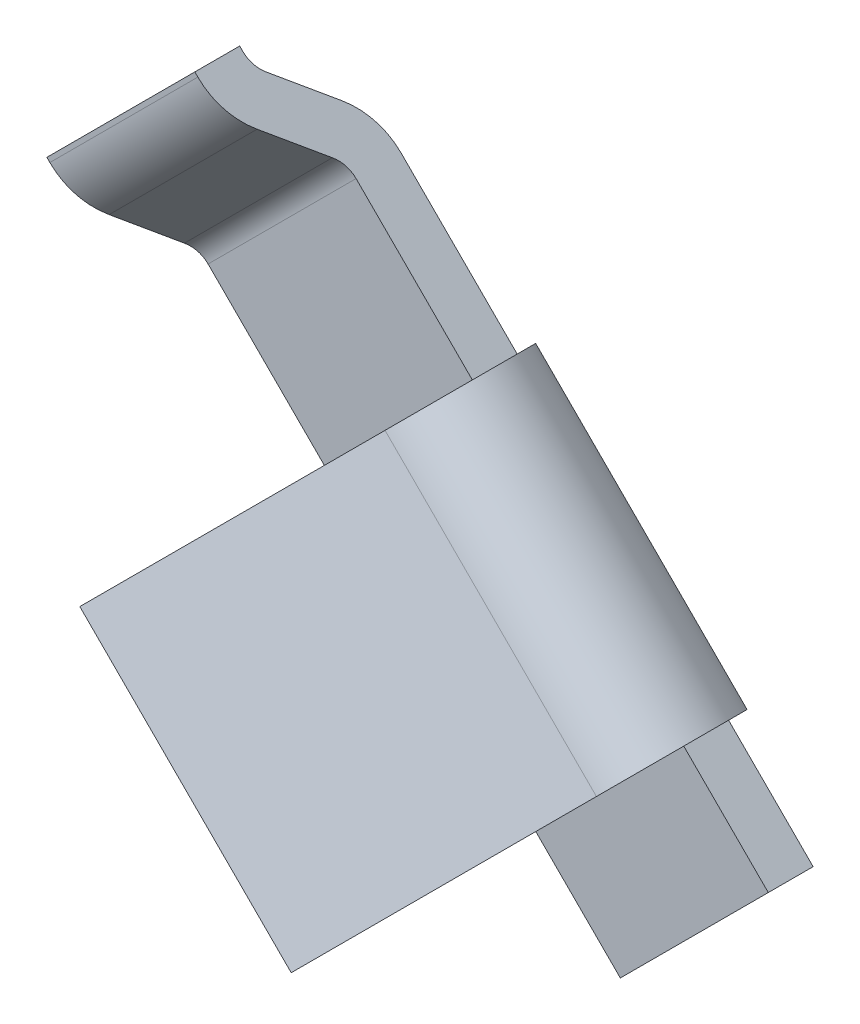
ISO-10303-21;
HEADER;
FILE_DESCRIPTION(('STEP AP214'),'2;1');
FILE_NAME('part.step','',(''),(''),'','','');
FILE_SCHEMA(('AUTOMOTIVE_DESIGN { 1 0 10303 214 1 1 1 1 }'));
ENDSEC;
DATA;
#1=APPLICATION_CONTEXT('core data for automotive mechanical design processes');
#2=APPLICATION_PROTOCOL_DEFINITION('international standard','automotive_design',2000,#1);
#3=PRODUCT_CONTEXT('',#1,'mechanical');
#4=PRODUCT('Part','Part','',(#3));
#5=PRODUCT_RELATED_PRODUCT_CATEGORY('part','',(#4));
#6=PRODUCT_DEFINITION_FORMATION('','',#4);
#7=PRODUCT_DEFINITION_CONTEXT('part definition',#1,'design');
#8=PRODUCT_DEFINITION('design','',#6,#7);
#9=PRODUCT_DEFINITION_SHAPE('','',#8);
#10=(LENGTH_UNIT() NAMED_UNIT(*) SI_UNIT(.MILLI.,.METRE.));
#11=(NAMED_UNIT(*) PLANE_ANGLE_UNIT() SI_UNIT($,.RADIAN.));
#12=(NAMED_UNIT(*) SI_UNIT($,.STERADIAN.) SOLID_ANGLE_UNIT());
#13=UNCERTAINTY_MEASURE_WITH_UNIT(LENGTH_MEASURE(1.E-05),#10,'distance_accuracy_value','');
#14=(GEOMETRIC_REPRESENTATION_CONTEXT(3) GLOBAL_UNCERTAINTY_ASSIGNED_CONTEXT((#13)) GLOBAL_UNIT_ASSIGNED_CONTEXT((#10,
#11,#12)) REPRESENTATION_CONTEXT('',''));
#15=CARTESIAN_POINT('',(0.,0.,0.));
#16=DIRECTION('',(0.,0.,1.));
#17=DIRECTION('',(1.,0.,0.));
#18=AXIS2_PLACEMENT_3D('',#15,#16,#17);
#19=CARTESIAN_POINT('',(4.200267948409,-3.705293201578,0.025));
#20=DIRECTION('',(0.707106781186548,-0.707106781186548,0.));
#21=DIRECTION('',(0.707106781186548,0.707106781186548,0.));
#22=AXIS2_PLACEMENT_3D('',#19,#20,#21);
#23=CYLINDRICAL_SURFACE('',#22,0.275);
#24=DIRECTION('',(-0.707106781187048,0.707106781186048,0.));
#25=VECTOR('',#24,1.);
#26=CARTESIAN_POINT('',(4.143071785687,-3.648097038856,-0.25));
#27=LINE('',#26,#25);
#28=CARTESIAN_POINT('',(4.143071785687,-3.648097038856,-0.25));
#29=VERTEX_POINT('',#28);
#30=CARTESIAN_POINT('',(3.43596500450025,-2.94099025766975,-0.25));
#31=VERTEX_POINT('',#30);
#32=EDGE_CURVE('E121',#29,#31,#27,.T.);
#33=ORIENTED_EDGE('',*,*,#32,.T.);
#34=CARTESIAN_POINT('',(3.4359650045005,-2.9409902576695,0.025));
#35=DIRECTION('',(0.707106781186548,-0.707106781186548,0.));
#36=DIRECTION('',(0.707106781186548,0.707106781186548,0.));
#37=AXIS2_PLACEMENT_3D('',#34,#35,#36);
#38=CIRCLE('',#37,0.275);
#39=CARTESIAN_POINT('',(3.51814497015121,-2.85881029201879,0.274234641435167));
#40=VERTEX_POINT('',#39);
#41=EDGE_CURVE('E19',#40,#31,#38,.F.);
#42=ORIENTED_EDGE('',*,*,#41,.F.);
#43=DIRECTION('',(-0.707106781186958,0.707106781186137,2.70833702686897E-13));
#44=VECTOR('',#43,1.);
#45=CARTESIAN_POINT('',(4.22525175133808,-3.56591707320492,0.274234641435235));
#46=LINE('',#45,#44);
#47=CARTESIAN_POINT('',(4.22525175133791,-3.56591707320509,0.274234641435203));
#48=VERTEX_POINT('',#47);
#49=EDGE_CURVE('E109',#48,#40,#46,.T.);
#50=ORIENTED_EDGE('',*,*,#49,.F.);
#51=CARTESIAN_POINT('',(4.143071785687,-3.648097038856,0.025));
#52=DIRECTION('',(0.707106781186548,-0.707106781186548,0.));
#53=DIRECTION('',(0.707106781186548,0.707106781186548,0.));
#54=AXIS2_PLACEMENT_3D('',#51,#52,#53);
#55=CIRCLE('',#54,0.275);
#56=EDGE_CURVE('E149',#29,#48,#55,.T.);
#57=ORIENTED_EDGE('',*,*,#56,.F.);
#58=EDGE_LOOP('',(#33,#42,#50,#57));
#59=FACE_BOUND('',#58,.T.);
#60=ADVANCED_FACE('F16',(#59),#23,.T.);
#61=CARTESIAN_POINT('',(2.902922843378,-3.474032418792,0.679948172706));
#62=DIRECTION('',(0.298836238729927,0.298836238729927,0.906307787036777));
#63=DIRECTION('',(0.949705125315019,0.,-0.313145613014751));
#64=AXIS2_PLACEMENT_3D('',#61,#62,#63);
#65=PLANE('',#64);
#66=DIRECTION('',(-0.707106781186547,0.707106781186547,0.));
#67=VECTOR('',#66,1.);
#68=CARTESIAN_POINT('',(3.61002962456409,-4.18113919997891,0.679948172706271));
#69=LINE('',#68,#67);
#70=CARTESIAN_POINT('',(2.90292284337786,-3.47403241879214,0.679948172706091));
#71=VERTEX_POINT('',#70);
#72=CARTESIAN_POINT('',(3.61002962456403,-4.18113919997897,0.679948172706091));
#73=VERTEX_POINT('',#72);
#74=EDGE_CURVE('E152',#71,#73,#69,.F.);
#75=ORIENTED_EDGE('',*,*,#74,.T.);
#76=DIRECTION('',(-0.640856382055891,-0.640856382055891,0.422618261740388));
#77=VECTOR('',#76,1.);
#78=CARTESIAN_POINT('',(4.225251751338,-3.565917073205,0.274234641435));
#79=LINE('',#78,#77);
#80=EDGE_CURVE('E188',#48,#73,#79,.T.);
#81=ORIENTED_EDGE('',*,*,#80,.F.);
#82=ORIENTED_EDGE('',*,*,#49,.T.);
#83=DIRECTION('',(0.640856382055705,0.640856382055705,-0.422618261740953));
#84=VECTOR('',#83,1.);
#85=CARTESIAN_POINT('',(2.902922843378,-3.474032418792,0.679948172706));
#86=LINE('',#85,#84);
#87=EDGE_CURVE('E144',#71,#40,#86,.T.);
#88=ORIENTED_EDGE('',*,*,#87,.F.);
#89=EDGE_LOOP('',(#75,#81,#82,#88));
#90=FACE_BOUND('',#89,.T.);
#91=ADVANCED_FACE('F260',(#90),#65,.T.);
#92=CARTESIAN_POINT('',(3.610029624564,-4.181139199979,0.679948172706));
#93=DIRECTION('',(0.640856382055745,0.640856382055745,-0.422618261740832));
#94=DIRECTION('',(-0.707106781186547,0.707106781186547,0.));
#95=AXIS2_PLACEMENT_3D('',#92,#93,#94);
#96=PLANE('',#95);
#97=DIRECTION('',(0.298836238733658,0.298836238733658,0.906307787034317));
#98=VECTOR('',#97,1.);
#99=CARTESIAN_POINT('',(2.858097407568,-3.518857854602,0.544002004651));
#100=LINE('',#99,#98);
#101=CARTESIAN_POINT('',(2.858097407568,-3.518857854602,0.544002004651));
#102=VERTEX_POINT('',#101);
#103=EDGE_CURVE('E193',#102,#71,#100,.T.);
#104=ORIENTED_EDGE('',*,*,#103,.F.);
#105=DIRECTION('',(-0.707106781186547,0.707106781186548,0.));
#106=VECTOR('',#105,1.);
#107=CARTESIAN_POINT('',(3.565204188755,-4.225964635789,0.544002004651));
#108=LINE('',#107,#106);
#109=CARTESIAN_POINT('',(3.5652041887545,-4.2259646357885,0.544002004651));
#110=VERTEX_POINT('',#109);
#111=EDGE_CURVE('E147',#110,#102,#108,.T.);
#112=ORIENTED_EDGE('',*,*,#111,.F.);
#113=DIRECTION('',(-0.298836238730918,-0.298836238730918,-0.906307787036124));
#114=VECTOR('',#113,1.);
#115=CARTESIAN_POINT('',(3.610029624564,-4.181139199979,0.679948172706));
#116=LINE('',#115,#114);
#117=EDGE_CURVE('E191',#73,#110,#116,.T.);
#118=ORIENTED_EDGE('',*,*,#117,.F.);
#119=ORIENTED_EDGE('',*,*,#74,.F.);
#120=EDGE_LOOP('',(#104,#112,#118,#119));
#121=FACE_BOUND('',#120,.T.);
#122=ADVANCED_FACE('F266',(#121),#96,.F.);
#123=CARTESIAN_POINT('',(3.930939751331,-4.425914498161,-0.25));
#124=DIRECTION('',(0.,0.,1.));
#125=DIRECTION('',(1.,0.,0.));
#126=AXIS2_PLACEMENT_3D('',#123,#124,#125);
#127=PLANE('',#126);
#128=ORIENTED_EDGE('',*,*,#32,.F.);
#129=DIRECTION('',(-0.707106781185297,0.707106781187798,0.));
#130=VECTOR('',#129,1.);
#131=CARTESIAN_POINT('',(4.425914498161,-3.930939751331,-0.25));
#132=LINE('',#131,#130);
#133=CARTESIAN_POINT('',(4.42591449816133,-3.93093975133067,-0.25));
#134=VERTEX_POINT('',#133);
#135=EDGE_CURVE('E150',#134,#29,#132,.T.);
#136=ORIENTED_EDGE('',*,*,#135,.F.);
#137=DIRECTION('',(-0.707106781186548,-0.707106781186548,0.));
#138=VECTOR('',#137,1.);
#139=CARTESIAN_POINT('',(3.930939751331,-4.425914498161,-0.25));
#140=LINE('',#139,#138);
#141=CARTESIAN_POINT('',(3.930939751331,-4.425914498161,-0.25));
#142=VERTEX_POINT('',#141);
#143=EDGE_CURVE('E240',#134,#142,#140,.T.);
#144=ORIENTED_EDGE('',*,*,#143,.T.);
#145=DIRECTION('',(0.707106781186548,-0.707106781186548,0.));
#146=VECTOR('',#145,1.);
#147=CARTESIAN_POINT('',(2.272792206136,-2.767766952966,-0.25));
#148=LINE('',#147,#146);
#149=CARTESIAN_POINT('',(2.55208152801725,-3.04705627484775,-0.25));
#150=VERTEX_POINT('',#149);
#151=EDGE_CURVE('E183',#150,#142,#148,.T.);
#152=ORIENTED_EDGE('',*,*,#151,.F.);
#153=DIRECTION('',(-0.707106781186548,-0.707106781186548,0.));
#154=VECTOR('',#153,1.);
#155=CARTESIAN_POINT('',(2.552081528017,-3.047056274848,-0.250000000000001));
#156=LINE('',#155,#154);
#157=CARTESIAN_POINT('',(3.047056274848,-2.552081528017,-0.25));
#158=VERTEX_POINT('',#157);
#159=EDGE_CURVE('E123',#158,#150,#156,.T.);
#160=ORIENTED_EDGE('',*,*,#159,.F.);
#161=DIRECTION('',(-0.707106781185638,0.707106781187457,0.));
#162=VECTOR('',#161,1.);
#163=CARTESIAN_POINT('',(3.4359650045,-2.94099025767,-0.25));
#164=LINE('',#163,#162);
#165=EDGE_CURVE('E116',#31,#158,#164,.T.);
#166=ORIENTED_EDGE('',*,*,#165,.F.);
#167=EDGE_LOOP('',(#128,#136,#144,#152,#160,#166));
#168=FACE_BOUND('',#167,.T.);
#169=ADVANCED_FACE('F118',(#168),#127,.F.);
#170=CARTESIAN_POINT('',(2.757716446628,-2.262741699797,50.532626326999));
#171=DIRECTION('',(0.707106781186548,-0.707106781186548,0.));
#172=DIRECTION('',(0.707106781186548,0.707106781186548,0.));
#173=AXIS2_PLACEMENT_3D('',#170,#171,#172);
#174=PLANE('',#173);
#175=DIRECTION('',(0.707106781186548,0.707106781186548,0.));
#176=VECTOR('',#175,1.);
#177=CARTESIAN_POINT('',(2.262741699797,-2.757716446628,0.));
#178=LINE('',#177,#176);
#179=CARTESIAN_POINT('',(2.26274169979733,-2.75771644662767,0.));
#180=VERTEX_POINT('',#179);
#181=CARTESIAN_POINT('',(2.757716446628,-2.262741699797,0.));
#182=VERTEX_POINT('',#181);
#183=EDGE_CURVE('E209',#180,#182,#178,.T.);
#184=ORIENTED_EDGE('',*,*,#183,.F.);
#185=DIRECTION('',(0.,0.,1.));
#186=VECTOR('',#185,1.);
#187=CARTESIAN_POINT('',(2.2627416997975,-2.7577164466275,0.15));
#188=LINE('',#187,#186);
#189=CARTESIAN_POINT('',(2.26274169979733,-2.75771644662767,0.15));
#190=VERTEX_POINT('',#189);
#191=EDGE_CURVE('E237',#190,#180,#188,.F.);
#192=ORIENTED_EDGE('',*,*,#191,.F.);
#193=DIRECTION('',(0.707106781186548,0.707106781186548,0.));
#194=VECTOR('',#193,1.);
#195=CARTESIAN_POINT('',(2.262741699797,-2.757716446628,0.15));
#196=LINE('',#195,#194);
#197=CARTESIAN_POINT('',(2.757716446628,-2.262741699797,0.15));
#198=VERTEX_POINT('',#197);
#199=EDGE_CURVE('E126',#190,#198,#196,.T.);
#200=ORIENTED_EDGE('',*,*,#199,.T.);
#201=DIRECTION('',(0.,0.,1.));
#202=VECTOR('',#201,1.);
#203=CARTESIAN_POINT('',(2.757716446628,-2.262741699797,0.15));
#204=LINE('',#203,#202);
#205=EDGE_CURVE('E215',#182,#198,#204,.T.);
#206=ORIENTED_EDGE('',*,*,#205,.F.);
#207=EDGE_LOOP('',(#184,#192,#200,#206));
#208=FACE_BOUND('',#207,.T.);
#209=ADVANCED_FACE('F357',(#208),#174,.F.);
#210=CARTESIAN_POINT('',(1.494974746831,-1.,0.15));
#211=DIRECTION('',(0.,0.,-1.));
#212=DIRECTION('',(-1.,0.,0.));
#213=AXIS2_PLACEMENT_3D('',#210,#211,#212);
#214=PLANE('',#213);
#215=ORIENTED_EDGE('',*,*,#199,.F.);
#216=DIRECTION('',(0.707106781186548,-0.707106781186548,0.));
#217=VECTOR('',#216,1.);
#218=CARTESIAN_POINT('',(2.272792206136,-2.767766952966,0.15));
#219=LINE('',#218,#217);
#220=CARTESIAN_POINT('',(2.272792206136,-2.767766952966,0.150000000000005));
#221=VERTEX_POINT('',#220);
#222=EDGE_CURVE('E175',#221,#190,#219,.F.);
#223=ORIENTED_EDGE('',*,*,#222,.F.);
#224=DIRECTION('',(-0.707106781186548,-0.707106781186548,0.));
#225=VECTOR('',#224,1.);
#226=CARTESIAN_POINT('',(2.272792206136,-2.767766952966,0.15000000000001));
#227=LINE('',#226,#225);
#228=CARTESIAN_POINT('',(2.76776695296625,-2.27279220613575,0.150000000000008));
#229=VERTEX_POINT('',#228);
#230=EDGE_CURVE('E231',#229,#221,#227,.T.);
#231=ORIENTED_EDGE('',*,*,#230,.F.);
#232=DIRECTION('',(-0.707106781186548,0.707106781186548,0.));
#233=VECTOR('',#232,1.);
#234=CARTESIAN_POINT('',(1.494974746831,-1.,0.15));
#235=LINE('',#234,#233);
#236=EDGE_CURVE('E170',#198,#229,#235,.F.);
#237=ORIENTED_EDGE('',*,*,#236,.F.);
#238=EDGE_LOOP('',(#215,#223,#231,#237));
#239=FACE_BOUND('',#238,.T.);
#240=ADVANCED_FACE('F364',(#239),#214,.F.);
#241=CARTESIAN_POINT('',(2.272792206136,-2.767766952966,-0.09999999999999));
#242=DIRECTION('',(-0.707106781186548,-0.707106781186548,0.));
#243=DIRECTION('',(0.707106781186548,-0.707106781186548,0.));
#244=AXIS2_PLACEMENT_3D('',#241,#242,#243);
#245=CYLINDRICAL_SURFACE('',#244,0.25);
#246=CARTESIAN_POINT('',(2.272792206136,-2.767766952966,-0.09999999999999));
#247=DIRECTION('',(-0.707106781186548,-0.707106781186548,0.));
#248=DIRECTION('',(0.707106781186548,-0.707106781186548,0.));
#249=AXIS2_PLACEMENT_3D('',#246,#247,#248);
#250=CIRCLE('',#249,0.25);
#251=CARTESIAN_POINT('',(2.39779220613595,-2.89276695296595,0.0767766952967078));
#252=VERTEX_POINT('',#251);
#253=EDGE_CURVE('E176',#252,#221,#250,.T.);
#254=ORIENTED_EDGE('',*,*,#253,.F.);
#255=DIRECTION('',(0.707106781186548,0.707106781186548,0.));
#256=VECTOR('',#255,1.);
#257=CARTESIAN_POINT('',(2.397792206136,-2.892766952966,0.07677669529664));
#258=LINE('',#257,#256);
#259=CARTESIAN_POINT('',(2.8927669529662,-2.3977922061357,0.0767766952967078));
#260=VERTEX_POINT('',#259);
#261=EDGE_CURVE('E226',#252,#260,#258,.T.);
#262=ORIENTED_EDGE('',*,*,#261,.T.);
#263=CARTESIAN_POINT('',(2.767766952966,-2.272792206136,-0.09999999999999));
#264=DIRECTION('',(-0.707106781186548,-0.707106781186548,0.));
#265=DIRECTION('',(0.707106781186548,-0.707106781186548,0.));
#266=AXIS2_PLACEMENT_3D('',#263,#264,#265);
#267=CIRCLE('',#266,0.25);
#268=EDGE_CURVE('E168',#229,#260,#267,.F.);
#269=ORIENTED_EDGE('',*,*,#268,.F.);
#270=ORIENTED_EDGE('',*,*,#230,.T.);
#271=EDGE_LOOP('',(#254,#262,#269,#270));
#272=FACE_BOUND('',#271,.T.);
#273=ADVANCED_FACE('F369',(#272),#245,.T.);
#274=CARTESIAN_POINT('',(2.397792206136,-2.892766952966,0.07677669529664));
#275=DIRECTION('',(-0.49999999999984,0.49999999999984,-0.707106781186774));
#276=DIRECTION('',(0.,0.8164965809279,0.577350269189379));
#277=AXIS2_PLACEMENT_3D('',#274,#275,#276);
#278=PLANE('',#277);
#279=ORIENTED_EDGE('',*,*,#261,.F.);
#280=DIRECTION('',(-0.500000000000373,0.500000000000373,0.70710678118602));
#281=VECTOR('',#280,1.);
#282=CARTESIAN_POINT('',(2.5020815280175,-2.9970562748475,-0.0707106781186501));
#283=LINE('',#282,#281);
#284=CARTESIAN_POINT('',(2.50208152801727,-2.99705627484777,-0.0707106781186784));
#285=VERTEX_POINT('',#284);
#286=EDGE_CURVE('E179',#285,#252,#283,.T.);
#287=ORIENTED_EDGE('',*,*,#286,.F.);
#288=DIRECTION('',(-0.707106781186548,-0.707106781186548,0.));
#289=VECTOR('',#288,1.);
#290=CARTESIAN_POINT('',(2.502081528017,-2.997056274848,-0.0707106781186525));
#291=LINE('',#290,#289);
#292=CARTESIAN_POINT('',(2.99705627484802,-2.50208152801702,-0.070710678118679));
#293=VERTEX_POINT('',#292);
#294=EDGE_CURVE('E174',#285,#293,#291,.F.);
#295=ORIENTED_EDGE('',*,*,#294,.T.);
#296=DIRECTION('',(0.500000000000371,-0.500000000000374,-0.707106781186021));
#297=VECTOR('',#296,1.);
#298=CARTESIAN_POINT('',(2.8927669529665,-2.3977922061355,0.07677669529664));
#299=LINE('',#298,#297);
#300=EDGE_CURVE('E167',#260,#293,#299,.T.);
#301=ORIENTED_EDGE('',*,*,#300,.F.);
#302=EDGE_LOOP('',(#279,#287,#295,#301));
#303=FACE_BOUND('',#302,.T.);
#304=ADVANCED_FACE('F371',(#303),#278,.F.);
#305=CARTESIAN_POINT('',(2.552081528017,-3.047056274848,0.));
#306=DIRECTION('',(-0.707106781186548,-0.707106781186548,0.));
#307=DIRECTION('',(0.707106781186548,-0.707106781186548,0.));
#308=AXIS2_PLACEMENT_3D('',#305,#306,#307);
#309=CYLINDRICAL_SURFACE('',#308,0.25);
#310=CARTESIAN_POINT('',(2.552081528017,-3.047056274848,0.));
#311=DIRECTION('',(-0.707106781186548,-0.707106781186548,0.));
#312=DIRECTION('',(0.707106781186548,-0.707106781186548,0.));
#313=AXIS2_PLACEMENT_3D('',#310,#311,#312);
#314=CIRCLE('',#313,0.25);
#315=CARTESIAN_POINT('',(2.42708152801718,-2.92205627484768,-0.176776695296838));
#316=VERTEX_POINT('',#315);
#317=EDGE_CURVE('E180',#316,#150,#314,.T.);
#318=ORIENTED_EDGE('',*,*,#317,.F.);
#319=DIRECTION('',(0.707106781186548,0.707106781186548,0.));
#320=VECTOR('',#319,1.);
#321=CARTESIAN_POINT('',(2.42708152801708,-2.92205627484808,-0.176776695296883));
#322=LINE('',#321,#320);
#323=CARTESIAN_POINT('',(2.92205627484795,-2.42708152801695,-0.176776695296809));
#324=VERTEX_POINT('',#323);
#325=EDGE_CURVE('E222',#316,#324,#322,.T.);
#326=ORIENTED_EDGE('',*,*,#325,.T.);
#327=CARTESIAN_POINT('',(3.047056274848,-2.552081528017,0.));
#328=DIRECTION('',(-0.707106781186548,-0.707106781186548,0.));
#329=DIRECTION('',(0.707106781186548,-0.707106781186548,0.));
#330=AXIS2_PLACEMENT_3D('',#327,#328,#329);
#331=CIRCLE('',#330,0.25);
#332=EDGE_CURVE('E138',#158,#324,#331,.F.);
#333=ORIENTED_EDGE('',*,*,#332,.F.);
#334=ORIENTED_EDGE('',*,*,#159,.T.);
#335=EDGE_LOOP('',(#318,#326,#333,#334));
#336=FACE_BOUND('',#335,.T.);
#337=ADVANCED_FACE('F502',(#336),#309,.T.);
#338=CARTESIAN_POINT('',(2.322792206136,-2.817766952966,-0.02928932188135));
#339=DIRECTION('',(0.49999999999984,-0.49999999999984,0.707106781186774));
#340=DIRECTION('',(0.,-0.8164965809279,-0.57735026918938));
#341=AXIS2_PLACEMENT_3D('',#338,#339,#340);
#342=PLANE('',#341);
#343=ORIENTED_EDGE('',*,*,#325,.F.);
#344=DIRECTION('',(0.499999999999763,-0.499999999999763,-0.707106781186883));
#345=VECTOR('',#344,1.);
#346=CARTESIAN_POINT('',(2.322792206136,-2.817766952966,-0.02928932188135));
#347=LINE('',#346,#345);
#348=CARTESIAN_POINT('',(2.32279220613601,-2.81776695296601,-0.0292893218813643));
#349=VERTEX_POINT('',#348);
#350=EDGE_CURVE('E184',#349,#316,#347,.T.);
#351=ORIENTED_EDGE('',*,*,#350,.F.);
#352=DIRECTION('',(-0.707106781186548,-0.707106781186548,0.));
#353=VECTOR('',#352,1.);
#354=CARTESIAN_POINT('',(2.322792206136,-2.817766952966,-0.0292893218813475));
#355=LINE('',#354,#353);
#356=CARTESIAN_POINT('',(2.81776695296626,-2.32279220613576,-0.0292893218813649));
#357=VERTEX_POINT('',#356);
#358=EDGE_CURVE('E212',#349,#357,#355,.F.);
#359=ORIENTED_EDGE('',*,*,#358,.T.);
#360=DIRECTION('',(-0.499999999999764,0.499999999999764,0.707106781186881));
#361=VECTOR('',#360,1.);
#362=CARTESIAN_POINT('',(2.922056274848,-2.427081528017,-0.176776695297));
#363=LINE('',#362,#361);
#364=EDGE_CURVE('E164',#324,#357,#363,.T.);
#365=ORIENTED_EDGE('',*,*,#364,.F.);
#366=EDGE_LOOP('',(#343,#351,#359,#365));
#367=FACE_BOUND('',#366,.T.);
#368=ADVANCED_FACE('F493',(#367),#342,.F.);
#369=CARTESIAN_POINT('',(2.272792206136,-2.767766952966,-0.1));
#370=DIRECTION('',(-0.707106781186548,-0.707106781186548,0.));
#371=DIRECTION('',(0.707106781186548,-0.707106781186548,0.));
#372=AXIS2_PLACEMENT_3D('',#369,#370,#371);
#373=CYLINDRICAL_SURFACE('',#372,0.1);
#374=ORIENTED_EDGE('',*,*,#358,.F.);
#375=CARTESIAN_POINT('',(2.272792206136,-2.767766952966,-0.1));
#376=DIRECTION('',(-0.707106781186548,-0.707106781186548,0.));
#377=DIRECTION('',(0.707106781186548,-0.707106781186548,0.));
#378=AXIS2_PLACEMENT_3D('',#375,#376,#377);
#379=CIRCLE('',#378,0.1);
#380=CARTESIAN_POINT('',(2.272792206136,-2.767766952966,0.));
#381=VERTEX_POINT('',#380);
#382=EDGE_CURVE('E185',#381,#349,#379,.F.);
#383=ORIENTED_EDGE('',*,*,#382,.F.);
#384=DIRECTION('',(-0.707106781186547,-0.707106781186547,0.));
#385=VECTOR('',#384,1.);
#386=CARTESIAN_POINT('',(2.767766952966,-2.272792206136,0.));
#387=LINE('',#386,#385);
#388=CARTESIAN_POINT('',(2.76776695296625,-2.27279220613575,0.));
#389=VERTEX_POINT('',#388);
#390=EDGE_CURVE('E207',#389,#381,#387,.T.);
#391=ORIENTED_EDGE('',*,*,#390,.F.);
#392=CARTESIAN_POINT('',(2.767766952966,-2.272792206136,-0.1));
#393=DIRECTION('',(-0.707106781186548,-0.707106781186548,0.));
#394=DIRECTION('',(0.707106781186548,-0.707106781186548,0.));
#395=AXIS2_PLACEMENT_3D('',#392,#393,#394);
#396=CIRCLE('',#395,0.1);
#397=EDGE_CURVE('E161',#357,#389,#396,.T.);
#398=ORIENTED_EDGE('',*,*,#397,.F.);
#399=EDGE_LOOP('',(#374,#383,#391,#398));
#400=FACE_BOUND('',#399,.T.);
#401=ADVANCED_FACE('F485',(#400),#373,.F.);
#402=CARTESIAN_POINT('',(1.494974746831,-1.,0.));
#403=DIRECTION('',(0.,0.,-1.));
#404=DIRECTION('',(-1.,0.,0.));
#405=AXIS2_PLACEMENT_3D('',#402,#403,#404);
#406=PLANE('',#405);
#407=ORIENTED_EDGE('',*,*,#390,.T.);
#408=DIRECTION('',(0.707106781186548,-0.707106781186548,0.));
#409=VECTOR('',#408,1.);
#410=CARTESIAN_POINT('',(2.272792206136,-2.767766952966,0.));
#411=LINE('',#410,#409);
#412=EDGE_CURVE('E187',#180,#381,#411,.T.);
#413=ORIENTED_EDGE('',*,*,#412,.F.);
#414=ORIENTED_EDGE('',*,*,#183,.T.);
#415=DIRECTION('',(-0.707106781186548,0.707106781186548,0.));
#416=VECTOR('',#415,1.);
#417=CARTESIAN_POINT('',(1.494974746831,-1.,0.));
#418=LINE('',#417,#416);
#419=EDGE_CURVE('E163',#389,#182,#418,.T.);
#420=ORIENTED_EDGE('',*,*,#419,.F.);
#421=EDGE_LOOP('',(#407,#413,#414,#420));
#422=FACE_BOUND('',#421,.T.);
#423=ADVANCED_FACE('F477',(#422),#406,.T.);
#424=CARTESIAN_POINT('',(3.565204188755,-4.225964635789,0.544002004651));
#425=DIRECTION('',(-0.298836238729927,-0.298836238729927,-0.906307787036777));
#426=DIRECTION('',(-0.949705125315019,0.,0.313145613014751));
#427=AXIS2_PLACEMENT_3D('',#424,#425,#426);
#428=PLANE('',#427);
#429=ORIENTED_EDGE('',*,*,#111,.T.);
#430=DIRECTION('',(-0.640856382055891,-0.640856382055891,0.422618261740388));
#431=VECTOR('',#430,1.);
#432=CARTESIAN_POINT('',(3.473319534342,-2.903635727828,0.13828847338));
#433=LINE('',#432,#431);
#434=CARTESIAN_POINT('',(3.47331953434187,-2.90363572782813,0.1382884733798));
#435=VERTEX_POINT('',#434);
#436=EDGE_CURVE('E146',#435,#102,#433,.T.);
#437=ORIENTED_EDGE('',*,*,#436,.F.);
#438=DIRECTION('',(0.707106781186548,-0.707106781186548,0.));
#439=VECTOR('',#438,1.);
#440=CARTESIAN_POINT('',(4.23762247825035,-3.66793867173666,0.138288473379529));
#441=LINE('',#440,#439);
#442=CARTESIAN_POINT('',(4.18042631552834,-3.61074250901466,0.138288473379656));
#443=VERTEX_POINT('',#442);
#444=EDGE_CURVE('E160',#435,#443,#441,.T.);
#445=ORIENTED_EDGE('',*,*,#444,.T.);
#446=DIRECTION('',(0.640856382055798,0.640856382055798,-0.422618261740671));
#447=VECTOR('',#446,1.);
#448=CARTESIAN_POINT('',(3.5652041887545,-4.2259646357885,0.544002004651));
#449=LINE('',#448,#447);
#450=EDGE_CURVE('E250',#110,#443,#449,.T.);
#451=ORIENTED_EDGE('',*,*,#450,.F.);
#452=EDGE_LOOP('',(#429,#437,#445,#451));
#453=FACE_BOUND('',#452,.T.);
#454=ADVANCED_FACE('F289',(#453),#428,.T.);
#455=CARTESIAN_POINT('',(3.473319534342,-2.903635727828,0.13828847338));
#456=DIRECTION('',(-0.707106781186548,0.707106781186548,0.));
#457=DIRECTION('',(-0.707106781186548,-0.707106781186548,0.));
#458=AXIS2_PLACEMENT_3D('',#455,#456,#457);
#459=PLANE('',#458);
#460=ORIENTED_EDGE('',*,*,#103,.T.);
#461=ORIENTED_EDGE('',*,*,#87,.T.);
#462=ORIENTED_EDGE('',*,*,#41,.T.);
#463=DIRECTION('',(0.,0.,1.));
#464=VECTOR('',#463,1.);
#465=CARTESIAN_POINT('',(3.4359650045005,-2.9409902576695,0.15));
#466=LINE('',#465,#464);
#467=CARTESIAN_POINT('',(3.43596500450025,-2.94099025766975,-0.1));
#468=VERTEX_POINT('',#467);
#469=EDGE_CURVE('E130',#468,#31,#466,.F.);
#470=ORIENTED_EDGE('',*,*,#469,.F.);
#471=CARTESIAN_POINT('',(3.4359650045005,-2.9409902576695,0.025));
#472=DIRECTION('',(0.707106781186548,-0.707106781186548,0.));
#473=DIRECTION('',(0.707106781186548,0.707106781186548,0.));
#474=AXIS2_PLACEMENT_3D('',#471,#472,#473);
#475=CIRCLE('',#474,0.125);
#476=EDGE_CURVE('E156',#468,#435,#475,.T.);
#477=ORIENTED_EDGE('',*,*,#476,.T.);
#478=ORIENTED_EDGE('',*,*,#436,.T.);
#479=EDGE_LOOP('',(#460,#461,#462,#470,#477,#478));
#480=FACE_BOUND('',#479,.T.);
#481=ADVANCED_FACE('F143',(#480),#459,.T.);
#482=CARTESIAN_POINT('',(4.225251751338,-3.565917073205,0.274234641435));
#483=DIRECTION('',(0.707106781186548,-0.707106781186548,0.));
#484=DIRECTION('',(0.707106781186548,0.707106781186548,0.));
#485=AXIS2_PLACEMENT_3D('',#482,#483,#484);
#486=PLANE('',#485);
#487=ORIENTED_EDGE('',*,*,#117,.T.);
#488=ORIENTED_EDGE('',*,*,#450,.T.);
#489=CARTESIAN_POINT('',(4.143071785687,-3.648097038856,0.025));
#490=DIRECTION('',(0.707106781186548,-0.707106781186548,0.));
#491=DIRECTION('',(0.707106781186548,0.707106781186548,0.));
#492=AXIS2_PLACEMENT_3D('',#489,#490,#491);
#493=CIRCLE('',#492,0.125);
#494=CARTESIAN_POINT('',(4.143071785687,-3.648097038856,-0.1));
#495=VERTEX_POINT('',#494);
#496=EDGE_CURVE('E158',#443,#495,#493,.F.);
#497=ORIENTED_EDGE('',*,*,#496,.T.);
#498=DIRECTION('',(0.,0.,1.));
#499=VECTOR('',#498,1.);
#500=CARTESIAN_POINT('',(4.143071785687,-3.648097038856,0.15));
#501=LINE('',#500,#499);
#502=EDGE_CURVE('E33',#29,#495,#501,.T.);
#503=ORIENTED_EDGE('',*,*,#502,.F.);
#504=ORIENTED_EDGE('',*,*,#56,.T.);
#505=ORIENTED_EDGE('',*,*,#80,.T.);
#506=EDGE_LOOP('',(#487,#488,#497,#503,#504,#505));
#507=FACE_BOUND('',#506,.T.);
#508=ADVANCED_FACE('F269',(#507),#486,.T.);
#509=CARTESIAN_POINT('',(3.930939751331,-4.425914498161,-0.1));
#510=DIRECTION('',(-0.707106781186548,0.707106781186548,0.));
#511=DIRECTION('',(-0.707106781186548,-0.707106781186548,0.));
#512=AXIS2_PLACEMENT_3D('',#509,#510,#511);
#513=PLANE('',#512);
#514=DIRECTION('',(-0.707106781186548,-0.707106781186548,0.));
#515=VECTOR('',#514,1.);
#516=CARTESIAN_POINT('',(4.425914498161,-3.930939751331,-0.1));
#517=LINE('',#516,#515);
#518=CARTESIAN_POINT('',(4.42591449816125,-3.93093975133075,-0.1));
#519=VERTEX_POINT('',#518);
#520=CARTESIAN_POINT('',(3.930939751331,-4.425914498161,-0.1));
#521=VERTEX_POINT('',#520);
#522=EDGE_CURVE('E306',#519,#521,#517,.T.);
#523=ORIENTED_EDGE('',*,*,#522,.T.);
#524=DIRECTION('',(0.,0.,1.));
#525=VECTOR('',#524,1.);
#526=CARTESIAN_POINT('',(3.930939751331,-4.425914498161,0.15));
#527=LINE('',#526,#525);
#528=EDGE_CURVE('E314',#142,#521,#527,.T.);
#529=ORIENTED_EDGE('',*,*,#528,.F.);
#530=ORIENTED_EDGE('',*,*,#143,.F.);
#531=DIRECTION('',(0.,0.,1.));
#532=VECTOR('',#531,1.);
#533=CARTESIAN_POINT('',(4.4259144981615,-3.9309397513305,0.15));
#534=LINE('',#533,#532);
#535=EDGE_CURVE('E303',#519,#134,#534,.F.);
#536=ORIENTED_EDGE('',*,*,#535,.F.);
#537=EDGE_LOOP('',(#523,#529,#530,#536));
#538=FACE_BOUND('',#537,.T.);
#539=ADVANCED_FACE('F392',(#538),#513,.F.);
#540=CARTESIAN_POINT('',(2.272792206136,-2.767766952966,0.15));
#541=DIRECTION('',(-0.707106781186548,-0.707106781186548,0.));
#542=DIRECTION('',(0.707106781186548,-0.707106781186548,0.));
#543=AXIS2_PLACEMENT_3D('',#540,#541,#542);
#544=PLANE('',#543);
#545=ORIENTED_EDGE('',*,*,#253,.T.);
#546=ORIENTED_EDGE('',*,*,#222,.T.);
#547=ORIENTED_EDGE('',*,*,#191,.T.);
#548=ORIENTED_EDGE('',*,*,#412,.T.);
#549=ORIENTED_EDGE('',*,*,#382,.T.);
#550=ORIENTED_EDGE('',*,*,#350,.T.);
#551=ORIENTED_EDGE('',*,*,#317,.T.);
#552=ORIENTED_EDGE('',*,*,#151,.T.);
#553=ORIENTED_EDGE('',*,*,#528,.T.);
#554=DIRECTION('',(-0.707106781186804,0.707106781186291,0.));
#555=VECTOR('',#554,1.);
#556=CARTESIAN_POINT('',(3.930939751331,-4.425914498161,-0.1));
#557=LINE('',#556,#555);
#558=CARTESIAN_POINT('',(2.552081528017,-3.047056274848,-0.1));
#559=VERTEX_POINT('',#558);
#560=EDGE_CURVE('E311',#521,#559,#557,.T.);
#561=ORIENTED_EDGE('',*,*,#560,.T.);
#562=CARTESIAN_POINT('',(2.552081528017,-3.047056274848,0.));
#563=DIRECTION('',(-0.707106781186548,-0.707106781186548,0.));
#564=DIRECTION('',(0.707106781186548,-0.707106781186548,0.));
#565=AXIS2_PLACEMENT_3D('',#562,#563,#564);
#566=CIRCLE('',#565,0.1);
#567=EDGE_CURVE('E171',#559,#285,#566,.F.);
#568=ORIENTED_EDGE('',*,*,#567,.T.);
#569=ORIENTED_EDGE('',*,*,#286,.T.);
#570=EDGE_LOOP('',(#545,#546,#547,#548,#549,#550,#551,#552,#553,#561,#568,#569));
#571=FACE_BOUND('',#570,.T.);
#572=ADVANCED_FACE('F387',(#571),#544,.T.);
#573=CARTESIAN_POINT('',(2.552081528017,-3.047056274848,0.));
#574=DIRECTION('',(-0.707106781186548,-0.707106781186548,0.));
#575=DIRECTION('',(0.707106781186548,-0.707106781186548,0.));
#576=AXIS2_PLACEMENT_3D('',#573,#574,#575);
#577=CYLINDRICAL_SURFACE('',#576,0.1);
#578=ORIENTED_EDGE('',*,*,#294,.F.);
#579=ORIENTED_EDGE('',*,*,#567,.F.);
#580=DIRECTION('',(0.707106781186548,0.707106781186548,0.));
#581=VECTOR('',#580,1.);
#582=CARTESIAN_POINT('',(2.552081528017,-3.047056274848,-0.1));
#583=LINE('',#582,#581);
#584=CARTESIAN_POINT('',(3.047056274848,-2.552081528017,-0.1));
#585=VERTEX_POINT('',#584);
#586=EDGE_CURVE('E337',#559,#585,#583,.T.);
#587=ORIENTED_EDGE('',*,*,#586,.T.);
#588=CARTESIAN_POINT('',(3.047056274848,-2.552081528017,0.));
#589=DIRECTION('',(-0.707106781186548,-0.707106781186548,0.));
#590=DIRECTION('',(0.707106781186548,-0.707106781186548,0.));
#591=AXIS2_PLACEMENT_3D('',#588,#589,#590);
#592=CIRCLE('',#591,0.1);
#593=EDGE_CURVE('E139',#293,#585,#592,.T.);
#594=ORIENTED_EDGE('',*,*,#593,.F.);
#595=EDGE_LOOP('',(#578,#579,#587,#594));
#596=FACE_BOUND('',#595,.T.);
#597=ADVANCED_FACE('F375',(#596),#577,.F.);
#598=CARTESIAN_POINT('',(1.494974746831,-1.,0.15));
#599=DIRECTION('',(0.707106781186548,0.707106781186548,0.));
#600=DIRECTION('',(-0.707106781186548,0.707106781186548,0.));
#601=AXIS2_PLACEMENT_3D('',#598,#599,#600);
#602=PLANE('',#601);
#603=ORIENTED_EDGE('',*,*,#397,.T.);
#604=ORIENTED_EDGE('',*,*,#419,.T.);
#605=ORIENTED_EDGE('',*,*,#205,.T.);
#606=ORIENTED_EDGE('',*,*,#236,.T.);
#607=ORIENTED_EDGE('',*,*,#268,.T.);
#608=ORIENTED_EDGE('',*,*,#300,.T.);
#609=ORIENTED_EDGE('',*,*,#593,.T.);
#610=DIRECTION('',(0.707106781185638,-0.707106781187457,0.));
#611=VECTOR('',#610,1.);
#612=CARTESIAN_POINT('',(3.047056274848,-2.552081528017,-0.1));
#613=LINE('',#612,#611);
#614=EDGE_CURVE('E134',#585,#468,#613,.T.);
#615=ORIENTED_EDGE('',*,*,#614,.T.);
#616=ORIENTED_EDGE('',*,*,#469,.T.);
#617=ORIENTED_EDGE('',*,*,#165,.T.);
#618=ORIENTED_EDGE('',*,*,#332,.T.);
#619=ORIENTED_EDGE('',*,*,#364,.T.);
#620=EDGE_LOOP('',(#603,#604,#605,#606,#607,#608,#609,#615,#616,#617,#618,#619));
#621=FACE_BOUND('',#620,.T.);
#622=ADVANCED_FACE('F132',(#621),#602,.T.);
#623=CARTESIAN_POINT('',(4.200267948409,-3.705293201578,0.025));
#624=DIRECTION('',(0.707106781186548,-0.707106781186548,0.));
#625=DIRECTION('',(0.707106781186548,0.707106781186548,0.));
#626=AXIS2_PLACEMENT_3D('',#623,#624,#625);
#627=CYLINDRICAL_SURFACE('',#626,0.125);
#628=DIRECTION('',(0.707106781187048,-0.707106781186048,0.));
#629=VECTOR('',#628,1.);
#630=CARTESIAN_POINT('',(3.4359650045,-2.94099025767,-0.1));
#631=LINE('',#630,#629);
#632=EDGE_CURVE('E25',#468,#495,#631,.T.);
#633=ORIENTED_EDGE('',*,*,#632,.T.);
#634=ORIENTED_EDGE('',*,*,#496,.F.);
#635=ORIENTED_EDGE('',*,*,#444,.F.);
#636=ORIENTED_EDGE('',*,*,#476,.F.);
#637=EDGE_LOOP('',(#633,#634,#635,#636));
#638=FACE_BOUND('',#637,.T.);
#639=ADVANCED_FACE('F287',(#638),#627,.F.);
#640=CARTESIAN_POINT('',(1.494974746831,-1.,0.15));
#641=DIRECTION('',(0.707106781186548,0.707106781186548,0.));
#642=DIRECTION('',(-0.707106781186548,0.707106781186548,0.));
#643=AXIS2_PLACEMENT_3D('',#640,#641,#642);
#644=PLANE('',#643);
#645=ORIENTED_EDGE('',*,*,#535,.T.);
#646=ORIENTED_EDGE('',*,*,#135,.T.);
#647=ORIENTED_EDGE('',*,*,#502,.T.);
#648=DIRECTION('',(0.707106781185297,-0.707106781187798,0.));
#649=VECTOR('',#648,1.);
#650=CARTESIAN_POINT('',(4.143071785687,-3.648097038856,-0.1));
#651=LINE('',#650,#649);
#652=EDGE_CURVE('E10',#495,#519,#651,.T.);
#653=ORIENTED_EDGE('',*,*,#652,.T.);
#654=EDGE_LOOP('',(#645,#646,#647,#653));
#655=FACE_BOUND('',#654,.T.);
#656=ADVANCED_FACE('F383',(#655),#644,.T.);
#657=CARTESIAN_POINT('',(3.930939751331,-4.425914498161,-0.1));
#658=DIRECTION('',(0.,0.,-1.));
#659=DIRECTION('',(-1.,0.,0.));
#660=AXIS2_PLACEMENT_3D('',#657,#658,#659);
#661=PLANE('',#660);
#662=ORIENTED_EDGE('',*,*,#632,.F.);
#663=ORIENTED_EDGE('',*,*,#614,.F.);
#664=ORIENTED_EDGE('',*,*,#586,.F.);
#665=ORIENTED_EDGE('',*,*,#560,.F.);
#666=ORIENTED_EDGE('',*,*,#522,.F.);
#667=ORIENTED_EDGE('',*,*,#652,.F.);
#668=EDGE_LOOP('',(#662,#663,#664,#665,#666,#667));
#669=FACE_BOUND('',#668,.T.);
#670=ADVANCED_FACE('F378',(#669),#661,.F.);
#671=CLOSED_SHELL('',(#60,#91,#122,#169,#209,#240,#273,#304,#337,#368,#401,#423,#454,#481,#508,
#539,#572,#597,#622,#639,#656,#670));
#672=MANIFOLD_SOLID_BREP('B1',#671);
#673=ADVANCED_BREP_SHAPE_REPRESENTATION('',(#18,#672),#14);
#674=SHAPE_DEFINITION_REPRESENTATION(#9,#673);
ENDSEC;
END-ISO-10303-21;
